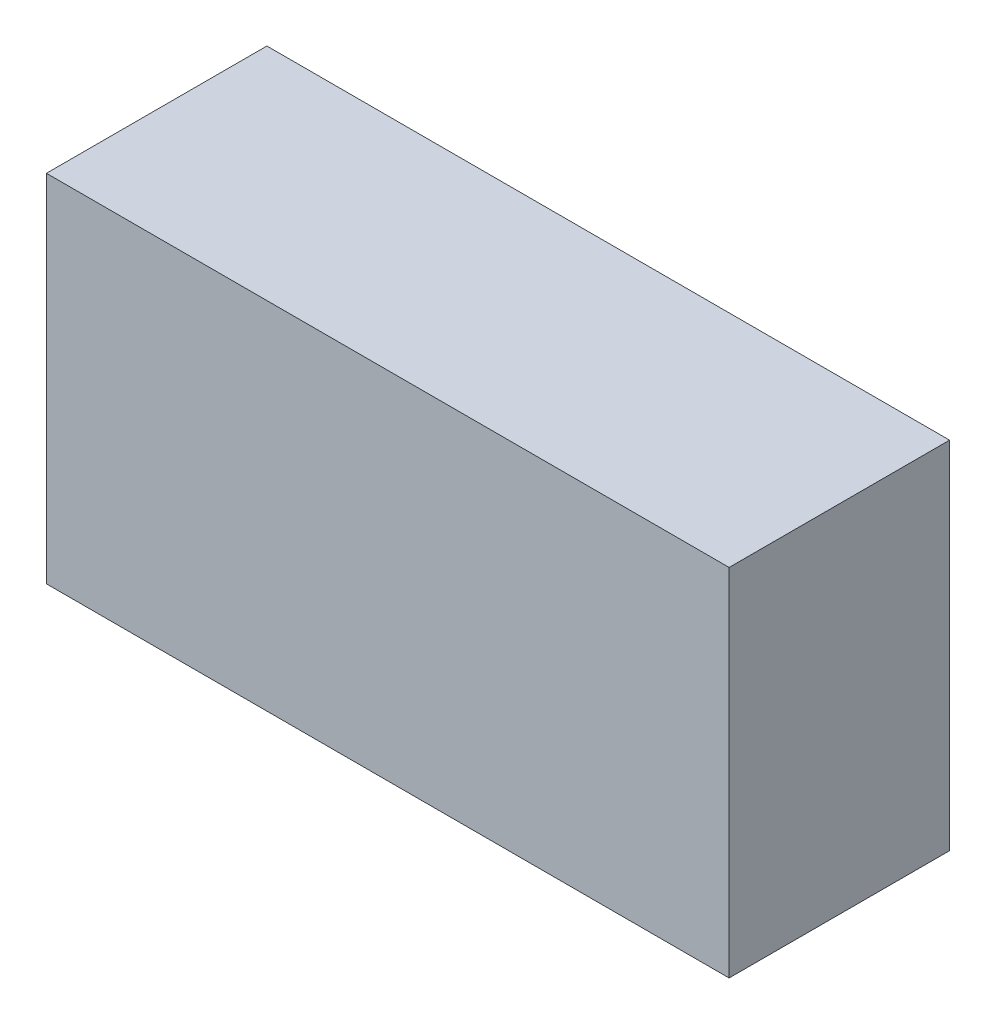
ISO-10303-21;
HEADER;
FILE_DESCRIPTION(('STEP AP214'),'2;1');
FILE_NAME('part.step','',(''),(''),'','','');
FILE_SCHEMA(('AUTOMOTIVE_DESIGN { 1 0 10303 214 1 1 1 1 }'));
ENDSEC;
DATA;
#1=APPLICATION_CONTEXT('core data for automotive mechanical design processes');
#2=APPLICATION_PROTOCOL_DEFINITION('international standard','automotive_design',2000,#1);
#3=PRODUCT_CONTEXT('',#1,'mechanical');
#4=PRODUCT('Part','Part','',(#3));
#5=PRODUCT_RELATED_PRODUCT_CATEGORY('part','',(#4));
#6=PRODUCT_DEFINITION_FORMATION('','',#4);
#7=PRODUCT_DEFINITION_CONTEXT('part definition',#1,'design');
#8=PRODUCT_DEFINITION('design','',#6,#7);
#9=PRODUCT_DEFINITION_SHAPE('','',#8);
#10=(LENGTH_UNIT() NAMED_UNIT(*) SI_UNIT(.MILLI.,.METRE.));
#11=(NAMED_UNIT(*) PLANE_ANGLE_UNIT() SI_UNIT($,.RADIAN.));
#12=(NAMED_UNIT(*) SI_UNIT($,.STERADIAN.) SOLID_ANGLE_UNIT());
#13=UNCERTAINTY_MEASURE_WITH_UNIT(LENGTH_MEASURE(1.E-05),#10,'distance_accuracy_value','');
#14=(GEOMETRIC_REPRESENTATION_CONTEXT(3) GLOBAL_UNCERTAINTY_ASSIGNED_CONTEXT((#13)) GLOBAL_UNIT_ASSIGNED_CONTEXT((#10,
#11,#12)) REPRESENTATION_CONTEXT('',''));
#15=CARTESIAN_POINT('',(0.,0.,0.));
#16=DIRECTION('',(0.,0.,1.));
#17=DIRECTION('',(1.,0.,0.));
#18=AXIS2_PLACEMENT_3D('',#15,#16,#17);
#19=CARTESIAN_POINT('',(-0.48,-0.25,0.02));
#20=DIRECTION('',(1.,0.,0.));
#21=DIRECTION('',(0.,0.,1.));
#22=AXIS2_PLACEMENT_3D('',#19,#20,#21);
#23=PLANE('',#22);
#24=DIRECTION('',(0.,1.,0.));
#25=VECTOR('',#24,1.);
#26=CARTESIAN_POINT('',(-0.48,-0.25,0.33));
#27=LINE('',#26,#25);
#28=CARTESIAN_POINT('',(-0.48,-0.25,0.33));
#29=VERTEX_POINT('',#28);
#30=CARTESIAN_POINT('',(-0.48,0.25,0.33));
#31=VERTEX_POINT('',#30);
#32=EDGE_CURVE('E11',#29,#31,#27,.T.);
#33=ORIENTED_EDGE('',*,*,#32,.T.);
#34=DIRECTION('',(0.,0.,1.));
#35=VECTOR('',#34,1.);
#36=CARTESIAN_POINT('',(-0.48,0.25,0.02));
#37=LINE('',#36,#35);
#38=CARTESIAN_POINT('',(-0.48,0.25,0.02));
#39=VERTEX_POINT('',#38);
#40=EDGE_CURVE('E24',#39,#31,#37,.T.);
#41=ORIENTED_EDGE('',*,*,#40,.F.);
#42=DIRECTION('',(0.,1.,0.));
#43=VECTOR('',#42,1.);
#44=CARTESIAN_POINT('',(-0.48,-0.25,0.02));
#45=LINE('',#44,#43);
#46=CARTESIAN_POINT('',(-0.48,-0.25,0.02));
#47=VERTEX_POINT('',#46);
#48=EDGE_CURVE('E62',#47,#39,#45,.T.);
#49=ORIENTED_EDGE('',*,*,#48,.F.);
#50=DIRECTION('',(0.,0.,1.));
#51=VECTOR('',#50,1.);
#52=CARTESIAN_POINT('',(-0.48,-0.25,0.02));
#53=LINE('',#52,#51);
#54=EDGE_CURVE('E36',#47,#29,#53,.T.);
#55=ORIENTED_EDGE('',*,*,#54,.T.);
#56=EDGE_LOOP('',(#33,#41,#49,#55));
#57=FACE_BOUND('',#56,.T.);
#58=ADVANCED_FACE('F17',(#57),#23,.F.);
#59=CARTESIAN_POINT('',(-0.48,-0.25,0.02));
#60=DIRECTION('',(0.,1.,0.));
#61=DIRECTION('',(0.,0.,1.));
#62=AXIS2_PLACEMENT_3D('',#59,#60,#61);
#63=PLANE('',#62);
#64=DIRECTION('',(0.,0.,1.));
#65=VECTOR('',#64,1.);
#66=CARTESIAN_POINT('',(0.48,-0.25,0.02));
#67=LINE('',#66,#65);
#68=CARTESIAN_POINT('',(0.48,-0.25,0.02));
#69=VERTEX_POINT('',#68);
#70=CARTESIAN_POINT('',(0.48,-0.25,0.33));
#71=VERTEX_POINT('',#70);
#72=EDGE_CURVE('E75',#69,#71,#67,.T.);
#73=ORIENTED_EDGE('',*,*,#72,.T.);
#74=DIRECTION('',(1.,0.,0.));
#75=VECTOR('',#74,1.);
#76=CARTESIAN_POINT('',(-0.48,-0.25,0.33));
#77=LINE('',#76,#75);
#78=EDGE_CURVE('E83',#29,#71,#77,.T.);
#79=ORIENTED_EDGE('',*,*,#78,.F.);
#80=ORIENTED_EDGE('',*,*,#54,.F.);
#81=DIRECTION('',(1.,0.,0.));
#82=VECTOR('',#81,1.);
#83=CARTESIAN_POINT('',(-0.48,-0.25,0.02));
#84=LINE('',#83,#82);
#85=EDGE_CURVE('E81',#47,#69,#84,.T.);
#86=ORIENTED_EDGE('',*,*,#85,.T.);
#87=EDGE_LOOP('',(#73,#79,#80,#86));
#88=FACE_BOUND('',#87,.T.);
#89=ADVANCED_FACE('F89',(#88),#63,.F.);
#90=CARTESIAN_POINT('',(-0.48,-0.25,0.33));
#91=DIRECTION('',(0.,0.,1.));
#92=DIRECTION('',(1.,0.,0.));
#93=AXIS2_PLACEMENT_3D('',#90,#91,#92);
#94=PLANE('',#93);
#95=ORIENTED_EDGE('',*,*,#32,.F.);
#96=ORIENTED_EDGE('',*,*,#78,.T.);
#97=DIRECTION('',(0.,1.,0.));
#98=VECTOR('',#97,1.);
#99=CARTESIAN_POINT('',(0.48,-0.25,0.33));
#100=LINE('',#99,#98);
#101=CARTESIAN_POINT('',(0.48,0.25,0.33));
#102=VERTEX_POINT('',#101);
#103=EDGE_CURVE('E79',#71,#102,#100,.T.);
#104=ORIENTED_EDGE('',*,*,#103,.T.);
#105=DIRECTION('',(1.,0.,0.));
#106=VECTOR('',#105,1.);
#107=CARTESIAN_POINT('',(-0.48,0.25,0.33));
#108=LINE('',#107,#106);
#109=EDGE_CURVE('E63',#31,#102,#108,.T.);
#110=ORIENTED_EDGE('',*,*,#109,.F.);
#111=EDGE_LOOP('',(#95,#96,#104,#110));
#112=FACE_BOUND('',#111,.T.);
#113=ADVANCED_FACE('F91',(#112),#94,.T.);
#114=CARTESIAN_POINT('',(-0.48,0.25,0.02));
#115=DIRECTION('',(0.,1.,0.));
#116=DIRECTION('',(0.,0.,1.));
#117=AXIS2_PLACEMENT_3D('',#114,#115,#116);
#118=PLANE('',#117);
#119=DIRECTION('',(1.,0.,0.));
#120=VECTOR('',#119,1.);
#121=CARTESIAN_POINT('',(-0.48,0.25,0.02));
#122=LINE('',#121,#120);
#123=CARTESIAN_POINT('',(0.48,0.25,0.02));
#124=VERTEX_POINT('',#123);
#125=EDGE_CURVE('E56',#39,#124,#122,.T.);
#126=ORIENTED_EDGE('',*,*,#125,.F.);
#127=ORIENTED_EDGE('',*,*,#40,.T.);
#128=ORIENTED_EDGE('',*,*,#109,.T.);
#129=DIRECTION('',(0.,0.,1.));
#130=VECTOR('',#129,1.);
#131=CARTESIAN_POINT('',(0.48,0.25,0.02));
#132=LINE('',#131,#130);
#133=EDGE_CURVE('E64',#124,#102,#132,.T.);
#134=ORIENTED_EDGE('',*,*,#133,.F.);
#135=EDGE_LOOP('',(#126,#127,#128,#134));
#136=FACE_BOUND('',#135,.T.);
#137=ADVANCED_FACE('F67',(#136),#118,.T.);
#138=CARTESIAN_POINT('',(-0.48,-0.25,0.02));
#139=DIRECTION('',(0.,0.,1.));
#140=DIRECTION('',(1.,0.,0.));
#141=AXIS2_PLACEMENT_3D('',#138,#139,#140);
#142=PLANE('',#141);
#143=ORIENTED_EDGE('',*,*,#125,.T.);
#144=DIRECTION('',(0.,1.,0.));
#145=VECTOR('',#144,1.);
#146=CARTESIAN_POINT('',(0.48,-0.25,0.02));
#147=LINE('',#146,#145);
#148=EDGE_CURVE('E61',#69,#124,#147,.T.);
#149=ORIENTED_EDGE('',*,*,#148,.F.);
#150=ORIENTED_EDGE('',*,*,#85,.F.);
#151=ORIENTED_EDGE('',*,*,#48,.T.);
#152=EDGE_LOOP('',(#143,#149,#150,#151));
#153=FACE_BOUND('',#152,.T.);
#154=ADVANCED_FACE('F58',(#153),#142,.F.);
#155=CARTESIAN_POINT('',(0.48,-0.25,0.02));
#156=DIRECTION('',(1.,0.,0.));
#157=DIRECTION('',(0.,0.,1.));
#158=AXIS2_PLACEMENT_3D('',#155,#156,#157);
#159=PLANE('',#158);
#160=ORIENTED_EDGE('',*,*,#72,.F.);
#161=ORIENTED_EDGE('',*,*,#148,.T.);
#162=ORIENTED_EDGE('',*,*,#133,.T.);
#163=ORIENTED_EDGE('',*,*,#103,.F.);
#164=EDGE_LOOP('',(#160,#161,#162,#163));
#165=FACE_BOUND('',#164,.T.);
#166=ADVANCED_FACE('F73',(#165),#159,.T.);
#167=CLOSED_SHELL('',(#58,#89,#113,#137,#154,#166));
#168=MANIFOLD_SOLID_BREP('B1',#167);
#169=ADVANCED_BREP_SHAPE_REPRESENTATION('',(#18,#168),#14);
#170=SHAPE_DEFINITION_REPRESENTATION(#9,#169);
ENDSEC;
END-ISO-10303-21;
